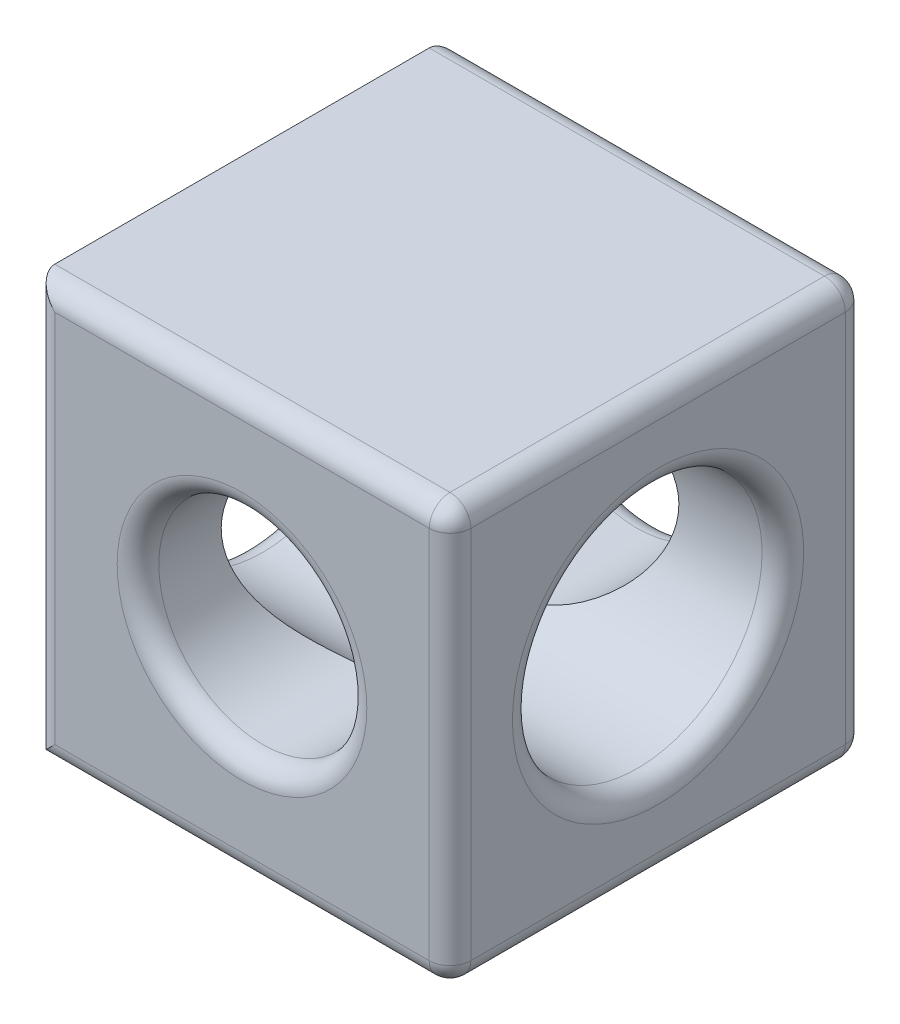
ISO-10303-21;
HEADER;
FILE_DESCRIPTION(('STEP AP214'),'2;1');
FILE_NAME('part.step','',(''),(''),'','','');
FILE_SCHEMA(('AUTOMOTIVE_DESIGN { 1 0 10303 214 1 1 1 1 }'));
ENDSEC;
DATA;
#1=APPLICATION_CONTEXT('core data for automotive mechanical design processes');
#2=APPLICATION_PROTOCOL_DEFINITION('international standard','automotive_design',2000,#1);
#3=PRODUCT_CONTEXT('',#1,'mechanical');
#4=PRODUCT('Part','Part','',(#3));
#5=PRODUCT_RELATED_PRODUCT_CATEGORY('part','',(#4));
#6=PRODUCT_DEFINITION_FORMATION('','',#4);
#7=PRODUCT_DEFINITION_CONTEXT('part definition',#1,'design');
#8=PRODUCT_DEFINITION('design','',#6,#7);
#9=PRODUCT_DEFINITION_SHAPE('','',#8);
#10=(LENGTH_UNIT() NAMED_UNIT(*) SI_UNIT(.MILLI.,.METRE.));
#11=(NAMED_UNIT(*) PLANE_ANGLE_UNIT() SI_UNIT($,.RADIAN.));
#12=(NAMED_UNIT(*) SI_UNIT($,.STERADIAN.) SOLID_ANGLE_UNIT());
#13=UNCERTAINTY_MEASURE_WITH_UNIT(LENGTH_MEASURE(1.E-05),#10,'distance_accuracy_value','');
#14=(GEOMETRIC_REPRESENTATION_CONTEXT(3) GLOBAL_UNCERTAINTY_ASSIGNED_CONTEXT((#13)) GLOBAL_UNIT_ASSIGNED_CONTEXT((#10,
#11,#12)) REPRESENTATION_CONTEXT('',''));
#15=CARTESIAN_POINT('',(0.,0.,0.));
#16=DIRECTION('',(0.,0.,1.));
#17=DIRECTION('',(1.,0.,0.));
#18=AXIS2_PLACEMENT_3D('',#15,#16,#17);
#19=CARTESIAN_POINT('',(0.,10.,10.));
#20=DIRECTION('',(1.,0.,0.));
#21=DIRECTION('',(0.,1.,0.));
#22=AXIS2_PLACEMENT_3D('',#19,#20,#21);
#23=PLANE('',#22);
#24=CARTESIAN_POINT('',(0.,5.,5.));
#25=DIRECTION('',(1.,0.,0.));
#26=DIRECTION('',(0.,1.,0.));
#27=AXIS2_PLACEMENT_3D('',#24,#25,#26);
#28=CIRCLE('',#27,3.5);
#29=CARTESIAN_POINT('',(0.,8.5,5.));
#30=VERTEX_POINT('',#29);
#31=EDGE_CURVE('E236',#30,#30,#28,.T.);
#32=ORIENTED_EDGE('',*,*,#31,.T.);
#33=EDGE_LOOP('',(#32));
#34=FACE_BOUND('',#33,.T.);
#35=DIRECTION('',(0.,0.,-1.));
#36=VECTOR('',#35,1.);
#37=CARTESIAN_POINT('',(0.,10.,10.));
#38=LINE('',#37,#36);
#39=CARTESIAN_POINT('',(0.,10.,9.5));
#40=VERTEX_POINT('',#39);
#41=CARTESIAN_POINT('',(0.,10.,0.5));
#42=VERTEX_POINT('',#41);
#43=EDGE_CURVE('E138',#40,#42,#38,.T.);
#44=ORIENTED_EDGE('',*,*,#43,.T.);
#45=DIRECTION('',(0.,-1.,0.));
#46=VECTOR('',#45,1.);
#47=CARTESIAN_POINT('',(0.,10.,0.5));
#48=LINE('',#47,#46);
#49=CARTESIAN_POINT('',(0.,0.,0.5));
#50=VERTEX_POINT('',#49);
#51=EDGE_CURVE('E137',#42,#50,#48,.T.);
#52=ORIENTED_EDGE('',*,*,#51,.T.);
#53=DIRECTION('',(0.,0.,-1.));
#54=VECTOR('',#53,1.);
#55=CARTESIAN_POINT('',(0.,0.,10.));
#56=LINE('',#55,#54);
#57=CARTESIAN_POINT('',(0.,0.,9.5));
#58=VERTEX_POINT('',#57);
#59=EDGE_CURVE('E121',#58,#50,#56,.T.);
#60=ORIENTED_EDGE('',*,*,#59,.F.);
#61=DIRECTION('',(0.,-1.,0.));
#62=VECTOR('',#61,1.);
#63=CARTESIAN_POINT('',(0.,10.,9.5));
#64=LINE('',#63,#62);
#65=EDGE_CURVE('E134',#58,#40,#64,.F.);
#66=ORIENTED_EDGE('',*,*,#65,.T.);
#67=EDGE_LOOP('',(#44,#52,#60,#66));
#68=FACE_BOUND('',#67,.T.);
#69=ADVANCED_FACE('F39',(#34,#68),#23,.F.);
#70=CARTESIAN_POINT('',(0.,0.,10.));
#71=DIRECTION('',(0.,1.,0.));
#72=DIRECTION('',(0.,0.,1.));
#73=AXIS2_PLACEMENT_3D('',#70,#71,#72);
#74=PLANE('',#73);
#75=ORIENTED_EDGE('',*,*,#59,.T.);
#76=DIRECTION('',(1.,0.,0.));
#77=VECTOR('',#76,1.);
#78=CARTESIAN_POINT('',(0.,0.,0.5));
#79=LINE('',#78,#77);
#80=CARTESIAN_POINT('',(9.5,0.,0.5));
#81=VERTEX_POINT('',#80);
#82=EDGE_CURVE('E228',#50,#81,#79,.T.);
#83=ORIENTED_EDGE('',*,*,#82,.T.);
#84=DIRECTION('',(0.,0.,-1.));
#85=VECTOR('',#84,1.);
#86=CARTESIAN_POINT('',(9.5,0.,10.));
#87=LINE('',#86,#85);
#88=CARTESIAN_POINT('',(9.5,0.,9.5));
#89=VERTEX_POINT('',#88);
#90=EDGE_CURVE('E124',#81,#89,#87,.F.);
#91=ORIENTED_EDGE('',*,*,#90,.T.);
#92=DIRECTION('',(1.,0.,0.));
#93=VECTOR('',#92,1.);
#94=CARTESIAN_POINT('',(0.,0.,9.5));
#95=LINE('',#94,#93);
#96=EDGE_CURVE('E117',#89,#58,#95,.F.);
#97=ORIENTED_EDGE('',*,*,#96,.T.);
#98=EDGE_LOOP('',(#75,#83,#91,#97));
#99=FACE_BOUND('',#98,.T.);
#100=ADVANCED_FACE('F119',(#99),#74,.F.);
#101=CARTESIAN_POINT('',(10.,10.,10.));
#102=DIRECTION('',(-1.,0.,0.));
#103=DIRECTION('',(0.,0.,1.));
#104=AXIS2_PLACEMENT_3D('',#101,#102,#103);
#105=PLANE('',#104);
#106=CARTESIAN_POINT('',(10.,5.,5.));
#107=DIRECTION('',(-1.,0.,0.));
#108=DIRECTION('',(0.,0.,1.));
#109=AXIS2_PLACEMENT_3D('',#106,#107,#108);
#110=CIRCLE('',#109,3.5);
#111=CARTESIAN_POINT('',(10.,5.,8.5));
#112=VERTEX_POINT('',#111);
#113=EDGE_CURVE('E195',#112,#112,#110,.T.);
#114=ORIENTED_EDGE('',*,*,#113,.T.);
#115=EDGE_LOOP('',(#114));
#116=FACE_BOUND('',#115,.T.);
#117=DIRECTION('',(0.,0.,-1.));
#118=VECTOR('',#117,1.);
#119=CARTESIAN_POINT('',(10.,0.5,10.));
#120=LINE('',#119,#118);
#121=CARTESIAN_POINT('',(10.,0.5,9.5));
#122=VERTEX_POINT('',#121);
#123=CARTESIAN_POINT('',(10.,0.5,0.5));
#124=VERTEX_POINT('',#123);
#125=EDGE_CURVE('E200',#122,#124,#120,.T.);
#126=ORIENTED_EDGE('',*,*,#125,.T.);
#127=DIRECTION('',(0.,1.,0.));
#128=VECTOR('',#127,1.);
#129=CARTESIAN_POINT('',(10.,10.,0.5));
#130=LINE('',#129,#128);
#131=CARTESIAN_POINT('',(10.,9.5,0.5));
#132=VERTEX_POINT('',#131);
#133=EDGE_CURVE('E198',#124,#132,#130,.T.);
#134=ORIENTED_EDGE('',*,*,#133,.T.);
#135=DIRECTION('',(0.,0.,-1.));
#136=VECTOR('',#135,1.);
#137=CARTESIAN_POINT('',(10.,9.5,10.));
#138=LINE('',#137,#136);
#139=CARTESIAN_POINT('',(10.,9.5,9.5));
#140=VERTEX_POINT('',#139);
#141=EDGE_CURVE('E203',#132,#140,#138,.F.);
#142=ORIENTED_EDGE('',*,*,#141,.T.);
#143=DIRECTION('',(0.,1.,0.));
#144=VECTOR('',#143,1.);
#145=CARTESIAN_POINT('',(10.,0.,9.5));
#146=LINE('',#145,#144);
#147=EDGE_CURVE('E205',#140,#122,#146,.F.);
#148=ORIENTED_EDGE('',*,*,#147,.T.);
#149=EDGE_LOOP('',(#126,#134,#142,#148));
#150=FACE_BOUND('',#149,.T.);
#151=ADVANCED_FACE('F278',(#116,#150),#105,.F.);
#152=CARTESIAN_POINT('',(0.,10.,10.));
#153=DIRECTION('',(0.,-1.,0.));
#154=DIRECTION('',(0.,0.,-1.));
#155=AXIS2_PLACEMENT_3D('',#152,#153,#154);
#156=PLANE('',#155);
#157=DIRECTION('',(0.,0.,-1.));
#158=VECTOR('',#157,1.);
#159=CARTESIAN_POINT('',(9.5,10.,10.));
#160=LINE('',#159,#158);
#161=CARTESIAN_POINT('',(9.5,10.,9.5));
#162=VERTEX_POINT('',#161);
#163=CARTESIAN_POINT('',(9.5,10.,0.5));
#164=VERTEX_POINT('',#163);
#165=EDGE_CURVE('E212',#162,#164,#160,.T.);
#166=ORIENTED_EDGE('',*,*,#165,.T.);
#167=DIRECTION('',(-1.,0.,0.));
#168=VECTOR('',#167,1.);
#169=CARTESIAN_POINT('',(0.,10.,0.5));
#170=LINE('',#169,#168);
#171=EDGE_CURVE('E210',#164,#42,#170,.T.);
#172=ORIENTED_EDGE('',*,*,#171,.T.);
#173=ORIENTED_EDGE('',*,*,#43,.F.);
#174=DIRECTION('',(-1.,0.,0.));
#175=VECTOR('',#174,1.);
#176=CARTESIAN_POINT('',(10.,10.,9.5));
#177=LINE('',#176,#175);
#178=EDGE_CURVE('E214',#40,#162,#177,.F.);
#179=ORIENTED_EDGE('',*,*,#178,.T.);
#180=EDGE_LOOP('',(#166,#172,#173,#179));
#181=FACE_BOUND('',#180,.T.);
#182=ADVANCED_FACE('F368',(#181),#156,.F.);
#183=CARTESIAN_POINT('',(0.,0.,10.));
#184=DIRECTION('',(0.,0.,1.));
#185=DIRECTION('',(1.,0.,0.));
#186=AXIS2_PLACEMENT_3D('',#183,#184,#185);
#187=PLANE('',#186);
#188=DIRECTION('',(0.,1.,0.));
#189=VECTOR('',#188,1.);
#190=CARTESIAN_POINT('',(9.5,10.,10.));
#191=LINE('',#190,#189);
#192=CARTESIAN_POINT('',(9.5,0.5,10.));
#193=VERTEX_POINT('',#192);
#194=CARTESIAN_POINT('',(9.5,9.5,10.));
#195=VERTEX_POINT('',#194);
#196=EDGE_CURVE('E56',#193,#195,#191,.T.);
#197=ORIENTED_EDGE('',*,*,#196,.T.);
#198=DIRECTION('',(-1.,0.,0.));
#199=VECTOR('',#198,1.);
#200=CARTESIAN_POINT('',(0.,9.5,10.));
#201=LINE('',#200,#199);
#202=CARTESIAN_POINT('',(0.5,9.5,10.));
#203=VERTEX_POINT('',#202);
#204=EDGE_CURVE('E48',#195,#203,#201,.T.);
#205=ORIENTED_EDGE('',*,*,#204,.T.);
#206=DIRECTION('',(0.,-1.,0.));
#207=VECTOR('',#206,1.);
#208=CARTESIAN_POINT('',(0.5,0.,10.));
#209=LINE('',#208,#207);
#210=CARTESIAN_POINT('',(0.5,0.5,10.));
#211=VERTEX_POINT('',#210);
#212=EDGE_CURVE('E190',#203,#211,#209,.T.);
#213=ORIENTED_EDGE('',*,*,#212,.T.);
#214=DIRECTION('',(1.,0.,0.));
#215=VECTOR('',#214,1.);
#216=CARTESIAN_POINT('',(10.,0.5,10.));
#217=LINE('',#216,#215);
#218=EDGE_CURVE('E61',#211,#193,#217,.T.);
#219=ORIENTED_EDGE('',*,*,#218,.T.);
#220=EDGE_LOOP('',(#197,#205,#213,#219));
#221=FACE_BOUND('',#220,.T.);
#222=CARTESIAN_POINT('',(5.,5.,10.));
#223=DIRECTION('',(0.,0.,1.));
#224=DIRECTION('',(1.,0.,0.));
#225=AXIS2_PLACEMENT_3D('',#222,#223,#224);
#226=CIRCLE('',#225,3.);
#227=CARTESIAN_POINT('',(8.,5.,10.));
#228=VERTEX_POINT('',#227);
#229=EDGE_CURVE('E192',#228,#228,#226,.F.);
#230=ORIENTED_EDGE('',*,*,#229,.T.);
#231=EDGE_LOOP('',(#230));
#232=FACE_BOUND('',#231,.T.);
#233=ADVANCED_FACE('F359',(#221,#232),#187,.T.);
#234=CARTESIAN_POINT('',(0.,0.,0.));
#235=DIRECTION('',(0.,0.,1.));
#236=DIRECTION('',(1.,0.,0.));
#237=AXIS2_PLACEMENT_3D('',#234,#235,#236);
#238=PLANE('',#237);
#239=CARTESIAN_POINT('',(5.,5.,0.));
#240=DIRECTION('',(0.,0.,1.));
#241=DIRECTION('',(1.,0.,0.));
#242=AXIS2_PLACEMENT_3D('',#239,#240,#241);
#243=CIRCLE('',#242,3.);
#244=CARTESIAN_POINT('',(8.,5.,0.));
#245=VERTEX_POINT('',#244);
#246=EDGE_CURVE('E216',#245,#245,#243,.T.);
#247=ORIENTED_EDGE('',*,*,#246,.T.);
#248=EDGE_LOOP('',(#247));
#249=FACE_BOUND('',#248,.T.);
#250=DIRECTION('',(1.,0.,0.));
#251=VECTOR('',#250,1.);
#252=CARTESIAN_POINT('',(0.,0.5,0.));
#253=LINE('',#252,#251);
#254=CARTESIAN_POINT('',(9.5,0.5,0.));
#255=VERTEX_POINT('',#254);
#256=CARTESIAN_POINT('',(0.5,0.5,0.));
#257=VERTEX_POINT('',#256);
#258=EDGE_CURVE('E221',#255,#257,#253,.F.);
#259=ORIENTED_EDGE('',*,*,#258,.T.);
#260=DIRECTION('',(0.,-1.,0.));
#261=VECTOR('',#260,1.);
#262=CARTESIAN_POINT('',(0.5,0.,0.));
#263=LINE('',#262,#261);
#264=CARTESIAN_POINT('',(0.5,9.5,0.));
#265=VERTEX_POINT('',#264);
#266=EDGE_CURVE('E219',#257,#265,#263,.F.);
#267=ORIENTED_EDGE('',*,*,#266,.T.);
#268=DIRECTION('',(-1.,0.,0.));
#269=VECTOR('',#268,1.);
#270=CARTESIAN_POINT('',(0.,9.5,0.));
#271=LINE('',#270,#269);
#272=CARTESIAN_POINT('',(9.5,9.5,0.));
#273=VERTEX_POINT('',#272);
#274=EDGE_CURVE('E224',#265,#273,#271,.F.);
#275=ORIENTED_EDGE('',*,*,#274,.T.);
#276=DIRECTION('',(0.,1.,0.));
#277=VECTOR('',#276,1.);
#278=CARTESIAN_POINT('',(9.5,0.,0.));
#279=LINE('',#278,#277);
#280=EDGE_CURVE('E226',#273,#255,#279,.F.);
#281=ORIENTED_EDGE('',*,*,#280,.T.);
#282=EDGE_LOOP('',(#259,#267,#275,#281));
#283=FACE_BOUND('',#282,.T.);
#284=ADVANCED_FACE('F349',(#249,#283),#238,.F.);
#285=CARTESIAN_POINT('',(0.,5.,5.));
#286=DIRECTION('',(1.,0.,0.));
#287=DIRECTION('',(0.,0.,-1.));
#288=AXIS2_PLACEMENT_3D('',#285,#286,#287);
#289=CYLINDRICAL_SURFACE('',#288,3.);
#290=CARTESIAN_POINT('',(0.5,5.,5.));
#291=DIRECTION('',(1.,0.,0.));
#292=DIRECTION('',(0.,1.,0.));
#293=AXIS2_PLACEMENT_3D('',#290,#291,#292);
#294=CIRCLE('',#293,3.);
#295=CARTESIAN_POINT('',(0.5,8.,5.));
#296=VERTEX_POINT('',#295);
#297=EDGE_CURVE('E129',#296,#296,#294,.F.);
#298=ORIENTED_EDGE('',*,*,#297,.T.);
#299=EDGE_LOOP('',(#298));
#300=FACE_BOUND('',#299,.T.);
#301=CARTESIAN_POINT('',(9.5,5.,5.));
#302=DIRECTION('',(-1.,0.,0.));
#303=DIRECTION('',(0.,0.,1.));
#304=AXIS2_PLACEMENT_3D('',#301,#302,#303);
#305=CIRCLE('',#304,3.);
#306=CARTESIAN_POINT('',(9.5,5.,8.));
#307=VERTEX_POINT('',#306);
#308=EDGE_CURVE('E233',#307,#307,#305,.F.);
#309=ORIENTED_EDGE('',*,*,#308,.T.);
#310=EDGE_LOOP('',(#309));
#311=FACE_BOUND('',#310,.T.);
#312=CARTESIAN_POINT('',(2.5,5.,2.));
#313=CARTESIAN_POINT('',(2.50000488555368,5.1187575331932,2.00000477204795));
#314=CARTESIAN_POINT('',(2.50852250390458,5.23755128110413,2.00711329405258));
#315=CARTESIAN_POINT('',(2.54196272335183,5.47118249249281,2.03489237131732));
#316=CARTESIAN_POINT('',(2.56689747397531,5.58601695961242,2.05557297057993));
#317=CARTESIAN_POINT('',(2.63131211733271,5.8078299424073,2.10857309761135));
#318=CARTESIAN_POINT('',(2.67070507435371,5.9148509209049,2.1408230344993));
#319=CARTESIAN_POINT('',(2.76201704794258,6.11984139043408,2.21470823817097));
#320=CARTESIAN_POINT('',(2.81394029667325,6.21780780775233,2.25634667565064));
#321=CARTESIAN_POINT('',(2.94945374980816,6.43789998519767,2.36325808470133));
#322=CARTESIAN_POINT('',(3.03767020418218,6.5556821965722,2.43159450743809));
#323=CARTESIAN_POINT('',(3.23052432575137,6.77202398328147,2.57577375222326));
#324=CARTESIAN_POINT('',(3.33520756924311,6.87052845158605,2.65163718546724));
#325=CARTESIAN_POINT('',(3.50408427649109,7.00437263805588,2.76705113686262));
#326=CARTESIAN_POINT('',(3.5629555761913,7.04699726278815,2.80616320005003));
#327=CARTESIAN_POINT('',(3.6845056029605,7.12715295529554,2.88379388190807));
#328=CARTESIAN_POINT('',(3.74718559487074,7.16468231743739,2.92231229804977));
#329=CARTESIAN_POINT('',(3.87626732433561,7.23441122570746,2.99749456711339));
#330=CARTESIAN_POINT('',(3.94265978472482,7.26662332666226,3.03416264245349));
#331=CARTESIAN_POINT('',(4.07944628392839,7.32553690612792,3.10422313369689));
#332=CARTESIAN_POINT('',(4.14983684734179,7.3522430799868,3.13761832779096));
#333=CARTESIAN_POINT('',(4.3016670902001,7.40193513934005,3.20208081019588));
#334=CARTESIAN_POINT('',(4.38352409272348,7.42433807692598,3.23263688748997));
#335=CARTESIAN_POINT('',(4.5518897688131,7.46101313675502,3.28406819443997));
#336=CARTESIAN_POINT('',(4.63838658661467,7.47530499393792,3.30496689805803));
#337=CARTESIAN_POINT('',(4.81576540837945,7.49481072799048,3.33379071031156));
#338=CARTESIAN_POINT('',(4.90668795907069,7.49991205058667,3.34155489436907));
#339=CARTESIAN_POINT('',(5.08856261300276,7.5000856937119,3.34181691468175));
#340=CARTESIAN_POINT('',(5.17951471661533,7.49515788278404,3.3343145508306));
#341=CARTESIAN_POINT('',(5.36552471082712,7.47505262029594,3.30458360535503));
#342=CARTESIAN_POINT('',(5.46029374571706,7.45905577113332,3.28118067933533));
#343=CARTESIAN_POINT('',(5.64421098120217,7.41742550503027,3.22311764261086));
#344=CARTESIAN_POINT('',(5.73333937071482,7.39176011044289,3.18842022896975));
#345=CARTESIAN_POINT('',(5.8878270785411,7.33816270346873,3.11997773873863));
#346=CARTESIAN_POINT('',(5.95431224241165,7.31177513033566,3.08749683154561));
#347=CARTESIAN_POINT('',(6.08365080677993,7.25404424958636,3.01978003338471));
#348=CARTESIAN_POINT('',(6.14650204786584,7.22269803586306,2.98454253302215));
#349=CARTESIAN_POINT('',(6.32996684101967,7.12149677560466,2.87657351890276));
#350=CARTESIAN_POINT('',(6.44541414760608,7.04450664231777,2.80162303032562));
#351=CARTESIAN_POINT('',(6.66826696245435,6.86765914501414,2.64920102047722));
#352=CARTESIAN_POINT('',(6.77493832399189,6.76681805277628,2.57180207381056));
#353=CARTESIAN_POINT('',(6.9711123448174,6.54484388336149,2.42490945956715));
#354=CARTESIAN_POINT('',(7.06065203305626,6.42375565615773,2.35539887732636));
#355=CARTESIAN_POINT('',(7.19941483909855,6.19411179169416,2.24571085873453));
#356=CARTESIAN_POINT('',(7.25314289818765,6.08972732107277,2.20251649926005));
#357=CARTESIAN_POINT('',(7.34634274525534,5.87107145833037,2.12692195980199));
#358=CARTESIAN_POINT('',(7.38582343158057,5.75680629278076,2.09451504339195));
#359=CARTESIAN_POINT('',(7.4484172499322,5.51995430121542,2.04290165734435));
#360=CARTESIAN_POINT('',(7.47140394665756,5.39731092312531,2.02379719044156));
#361=CARTESIAN_POINT('',(7.49870923192718,5.14855997692373,2.00108565471028));
#362=CARTESIAN_POINT('',(7.50304031085016,5.022454783524,1.99746821695823));
#363=CARTESIAN_POINT('',(7.49333756055624,4.78668980054343,2.00555000960853));
#364=CARTESIAN_POINT('',(7.48144136128483,4.67686945916414,2.01546649283687));
#365=CARTESIAN_POINT('',(7.44373304978851,4.4613550355994,2.04674410539865));
#366=CARTESIAN_POINT('',(7.41791926828104,4.35566145001044,2.06810660757204));
#367=CARTESIAN_POINT('',(7.35337660454474,4.14943450080075,2.12110478453814));
#368=CARTESIAN_POINT('',(7.31447921055573,4.04898931777669,2.15287435108026));
#369=CARTESIAN_POINT('',(7.2256043676633,3.85634099101897,2.2246387526611));
#370=CARTESIAN_POINT('',(7.17562282300671,3.7641409116879,2.26463662778192));
#371=CARTESIAN_POINT('',(7.04156820465303,3.54932560264901,2.37024847841406));
#372=CARTESIAN_POINT('',(6.9522674167327,3.43165640459269,2.43929755765286));
#373=CARTESIAN_POINT('',(6.75715961734437,3.21571005259153,2.58477554596809));
#374=CARTESIAN_POINT('',(6.65130154464526,3.11749509144827,2.66122699577165));
#375=CARTESIAN_POINT('',(6.48058803207139,2.98426685215709,2.77730194401399));
#376=CARTESIAN_POINT('',(6.42110172702402,2.94188930856051,2.8165884826397));
#377=CARTESIAN_POINT('',(6.29827918396773,2.86228330402594,2.89446846182819));
#378=CARTESIAN_POINT('',(6.2349415723359,2.82505669593245,2.93306164866393));
#379=CARTESIAN_POINT('',(6.10451159608481,2.75601142973243,3.0082389151736));
#380=CARTESIAN_POINT('',(6.0374297754664,2.72417851218462,3.04482811365788));
#381=CARTESIAN_POINT('',(5.89920989550017,2.6661114326054,3.11452438551821));
#382=CARTESIAN_POINT('',(5.82807562958063,2.63987214015345,3.1476346354921));
#383=CARTESIAN_POINT('',(5.67572963164812,2.59162642851678,3.21074442583953));
#384=CARTESIAN_POINT('',(5.59416554892628,2.57011685681456,3.24029288213346));
#385=CARTESIAN_POINT('',(5.4265480460574,2.53517744310486,3.28956936112573));
#386=CARTESIAN_POINT('',(5.34050642867212,2.52172742286643,3.30932188774741));
#387=CARTESIAN_POINT('',(5.16436239258767,2.50382710464737,3.3358468402054));
#388=CARTESIAN_POINT('',(5.07422467024932,2.4994820081604,3.34246748951609));
#389=CARTESIAN_POINT('',(4.89414678721606,2.50061802895545,3.34075691369333));
#390=CARTESIAN_POINT('',(4.80420668487486,2.50610173725988,3.33242174597845));
#391=CARTESIAN_POINT('',(4.61832742460948,2.5273473615146,3.30107101264481));
#392=CARTESIAN_POINT('',(4.52276972946732,2.54414187449239,3.27658628976142));
#393=CARTESIAN_POINT('',(4.33746870391729,2.58749660324909,3.21641271962613));
#394=CARTESIAN_POINT('',(4.2477457712907,2.61408911714091,3.18068687468674));
#395=CARTESIAN_POINT('',(4.09221095864516,2.66949164155081,3.11047380633806));
#396=CARTESIAN_POINT('',(4.02525624076508,2.69674146950469,3.07722183372209));
#397=CARTESIAN_POINT('',(3.8950536135756,2.75629372981988,3.0080481476943));
#398=CARTESIAN_POINT('',(3.83180788900019,2.78859909979136,2.97212488849481));
#399=CARTESIAN_POINT('',(3.64727043865804,2.89283705571015,2.86224068832088));
#400=CARTESIAN_POINT('',(3.53125307500807,2.97206423256249,2.7862021983568));
#401=CARTESIAN_POINT('',(3.30799273870875,3.15370302432586,2.63227396236454));
#402=CARTESIAN_POINT('',(3.20145820596708,3.2570604040672,2.55447605570488));
#403=CARTESIAN_POINT('',(3.00613620046066,3.48446445064379,2.40743501572246));
#404=CARTESIAN_POINT('',(2.91730943412605,3.60846416336785,2.33817307456932));
#405=CARTESIAN_POINT('',(2.78168580327691,3.84144481858917,2.23057694218492));
#406=CARTESIAN_POINT('',(2.72996148978056,3.94600122052306,2.18887825993118));
#407=CARTESIAN_POINT('',(2.64078132976142,4.16456021394564,2.11638539333548));
#408=CARTESIAN_POINT('',(2.60330647590471,4.27854997324609,2.0855766867623));
#409=CARTESIAN_POINT('',(2.54981154417341,4.49337996111314,2.0414125409531));
#410=CARTESIAN_POINT('',(2.53122487777322,4.59315453123808,2.02597857601889));
#411=CARTESIAN_POINT('',(2.50631763176192,4.79527727434576,2.00527077205592));
#412=CARTESIAN_POINT('',(2.49999578841308,4.89762518107722,1.99999588626059));
#413=CARTESIAN_POINT('',(2.5,5.,2.));
#414=B_SPLINE_CURVE_WITH_KNOTS('',3,(#312,#313,#314,#315,#316,#317,#318,#319,#320,#321,#322,
#323,#324,#325,#326,#327,#328,#329,#330,#331,#332,#333,#334,#335,#336,#337,#338,#339,#340,#341,
#342,#343,#344,#345,#346,#347,#348,#349,#350,#351,#352,#353,#354,#355,#356,#357,#358,#359,#360,
#361,#362,#363,#364,#365,#366,#367,#368,#369,#370,#371,#372,#373,#374,#375,#376,#377,#378,#379,
#380,#381,#382,#383,#384,#385,#386,#387,#388,#389,#390,#391,#392,#393,#394,#395,#396,#397,#398,
#399,#400,#401,#402,#403,#404,#405,#406,#407,#408,#409,#410,#411,#412,#413),.UNSPECIFIED.,.T.,
.F.,(4,2,2,2,2,2,2,2,2,2,2,2,2,2,2,2,2,2,2,2,2,2,2,2,2,2,2,2,2,2,2,2,2,2,2,2,2,2,2,2,2,2,2,2,2,
2,2,2,2,2,4),(0.,0.355841276815113,0.711946191026961,1.06594405359551,1.42006164830116,
1.90425178760126,2.38980643116775,2.63722280423449,2.88472179650724,3.13162777943676,
3.37832232674674,3.64812890035755,3.91727616616869,4.18969776924975,4.46212294312047,
4.75723524199722,5.05333228584568,5.28870178855694,5.52420974868633,5.9954933935898,
6.49137310548271,6.98616858956867,7.36002155957575,7.73364063000475,8.11009395319721,
8.4862951927436,8.81743460677926,9.14861374669871,9.48423297747606,9.81997643164433,
10.3065635514456,10.7946819775667,11.0432812121088,11.2919696391639,11.5399899810636,
11.787781852862,12.0551105531685,12.3217671309317,12.5914881373799,12.8612802568452,
13.1598101383752,13.4593330283462,13.6977271411687,13.9362602949129,14.4135864576438,
14.914300110886,15.413889999571,15.7841228897598,16.1538601797496,16.4606444271243,
16.7673970625124),.UNSPECIFIED.);
#415=CARTESIAN_POINT('',(2.5,5.,2.));
#416=VERTEX_POINT('',#415);
#417=EDGE_CURVE('E240',#416,#416,#414,.T.);
#418=ORIENTED_EDGE('',*,*,#417,.T.);
#419=EDGE_LOOP('',(#418));
#420=FACE_BOUND('',#419,.T.);
#421=CARTESIAN_POINT('',(7.5,5.,8.));
#422=CARTESIAN_POINT('',(7.49999511444632,5.1187575331932,7.99999522795205));
#423=CARTESIAN_POINT('',(7.49147749609542,5.23755128110413,7.99288670594743));
#424=CARTESIAN_POINT('',(7.45803727664816,5.47118249249281,7.96510762868268));
#425=CARTESIAN_POINT('',(7.43310252602469,5.58601695961242,7.94442702942008));
#426=CARTESIAN_POINT('',(7.36868788266729,5.8078299424073,7.89142690238865));
#427=CARTESIAN_POINT('',(7.32929492564629,5.9148509209049,7.8591769655007));
#428=CARTESIAN_POINT('',(7.23798295205742,6.11984139043408,7.78529176182902));
#429=CARTESIAN_POINT('',(7.18605970332675,6.21780780775233,7.74365332434936));
#430=CARTESIAN_POINT('',(7.05054625019184,6.43789998519767,7.63674191529867));
#431=CARTESIAN_POINT('',(6.96232979581782,6.5556821965722,7.56840549256191));
#432=CARTESIAN_POINT('',(6.76947567424863,6.77202398328147,7.42422624777674));
#433=CARTESIAN_POINT('',(6.66479243075689,6.87052845158605,7.34836281453276));
#434=CARTESIAN_POINT('',(6.49591572350891,7.00437263805588,7.23294886313738));
#435=CARTESIAN_POINT('',(6.4370444238087,7.04699726278815,7.19383679994997));
#436=CARTESIAN_POINT('',(6.3154943970395,7.12715295529554,7.11620611809193));
#437=CARTESIAN_POINT('',(6.25281440512926,7.16468231743739,7.07768770195023));
#438=CARTESIAN_POINT('',(6.12373267566439,7.23441122570746,7.00250543288661));
#439=CARTESIAN_POINT('',(6.05734021527518,7.26662332666226,6.96583735754651));
#440=CARTESIAN_POINT('',(5.92055371607161,7.32553690612792,6.89577686630311));
#441=CARTESIAN_POINT('',(5.85016315265821,7.3522430799868,6.86238167220904));
#442=CARTESIAN_POINT('',(5.6983329097999,7.40193513934005,6.79791918980412));
#443=CARTESIAN_POINT('',(5.61647590727652,7.42433807692598,6.76736311251003));
#444=CARTESIAN_POINT('',(5.4481102311869,7.46101313675502,6.71593180556004));
#445=CARTESIAN_POINT('',(5.36161341338533,7.47530499393792,6.69503310194197));
#446=CARTESIAN_POINT('',(5.18423459162055,7.49481072799048,6.66620928968844));
#447=CARTESIAN_POINT('',(5.09331204092931,7.49991205058667,6.65844510563093));
#448=CARTESIAN_POINT('',(4.91143738699724,7.5000856937119,6.65818308531825));
#449=CARTESIAN_POINT('',(4.82048528338467,7.49515788278404,6.6656854491694));
#450=CARTESIAN_POINT('',(4.63447528917288,7.47505262029594,6.69541639464497));
#451=CARTESIAN_POINT('',(4.53970625428294,7.45905577113332,6.71881932066467));
#452=CARTESIAN_POINT('',(4.35578901879783,7.41742550503027,6.77688235738914));
#453=CARTESIAN_POINT('',(4.26666062928518,7.3917601104429,6.81157977103025));
#454=CARTESIAN_POINT('',(4.1121729214589,7.33816270346873,6.88002226126137));
#455=CARTESIAN_POINT('',(4.04568775758835,7.31177513033566,6.91250316845439));
#456=CARTESIAN_POINT('',(3.91634919322007,7.25404424958636,6.98021996661529));
#457=CARTESIAN_POINT('',(3.85349795213416,7.22269803586306,7.01545746697786));
#458=CARTESIAN_POINT('',(3.67003315898033,7.12149677560466,7.12342648109725));
#459=CARTESIAN_POINT('',(3.55458585239391,7.04450664231777,7.19837696967438));
#460=CARTESIAN_POINT('',(3.33173303754565,6.86765914501414,7.35079897952278));
#461=CARTESIAN_POINT('',(3.22506167600811,6.76681805277628,7.42819792618945));
#462=CARTESIAN_POINT('',(3.0288876551826,6.54484388336149,7.57509054043285));
#463=CARTESIAN_POINT('',(2.93934796694374,6.42375565615773,7.64460112267364));
#464=CARTESIAN_POINT('',(2.80058516090145,6.19411179169415,7.75428914126547));
#465=CARTESIAN_POINT('',(2.74685710181235,6.08972732107277,7.79748350073996));
#466=CARTESIAN_POINT('',(2.65365725474466,5.87107145833036,7.87307804019801));
#467=CARTESIAN_POINT('',(2.61417656841942,5.75680629278076,7.90548495660805));
#468=CARTESIAN_POINT('',(2.5515827500678,5.51995430121542,7.95709834265565));
#469=CARTESIAN_POINT('',(2.52859605334244,5.39731092312531,7.97620280955844));
#470=CARTESIAN_POINT('',(2.50129076807281,5.14855997692372,7.99891434528972));
#471=CARTESIAN_POINT('',(2.49695968914984,5.022454783524,8.00253178304177));
#472=CARTESIAN_POINT('',(2.50666243944376,4.78668980054342,7.99444999039147));
#473=CARTESIAN_POINT('',(2.51855863871517,4.67686945916414,7.98453350716313));
#474=CARTESIAN_POINT('',(2.55626695021149,4.46135503559939,7.95325589460135));
#475=CARTESIAN_POINT('',(2.58208073171896,4.35566145001044,7.93189339242796));
#476=CARTESIAN_POINT('',(2.64662339545526,4.14943450080074,7.87889521546186));
#477=CARTESIAN_POINT('',(2.68552078944427,4.04898931777668,7.84712564891974));
#478=CARTESIAN_POINT('',(2.7743956323367,3.85634099101896,7.77536124733889));
#479=CARTESIAN_POINT('',(2.82437717699329,3.7641409116879,7.73536337221808));
#480=CARTESIAN_POINT('',(2.95843179534697,3.549325602649,7.62975152158594));
#481=CARTESIAN_POINT('',(3.04773258326731,3.43165640459269,7.56070244234714));
#482=CARTESIAN_POINT('',(3.24284038265564,3.21571005259152,7.4152244540319));
#483=CARTESIAN_POINT('',(3.34869845535475,3.11749509144827,7.33877300422834));
#484=CARTESIAN_POINT('',(3.51941196792862,2.98426685215709,7.222698055986));
#485=CARTESIAN_POINT('',(3.57889827297599,2.94188930856051,7.1834115173603));
#486=CARTESIAN_POINT('',(3.70172081603228,2.86228330402594,7.10553153817181));
#487=CARTESIAN_POINT('',(3.7650584276641,2.82505669593245,7.06693835133607));
#488=CARTESIAN_POINT('',(3.89548840391519,2.75601142973243,6.99176108482639));
#489=CARTESIAN_POINT('',(3.96257022453361,2.72417851218462,6.95517188634212));
#490=CARTESIAN_POINT('',(4.10079010449983,2.6661114326054,6.88547561448179));
#491=CARTESIAN_POINT('',(4.17192437041937,2.63987214015345,6.8523653645079));
#492=CARTESIAN_POINT('',(4.32427036835189,2.59162642851678,6.78925557416047));
#493=CARTESIAN_POINT('',(4.40583445107373,2.57011685681455,6.75970711786653));
#494=CARTESIAN_POINT('',(4.57345195394261,2.53517744310486,6.71043063887427));
#495=CARTESIAN_POINT('',(4.65949357132788,2.52172742286643,6.69067811225259));
#496=CARTESIAN_POINT('',(4.83563760741234,2.50382710464737,6.6641531597946));
#497=CARTESIAN_POINT('',(4.92577532975069,2.4994820081604,6.65753251048391));
#498=CARTESIAN_POINT('',(5.10585321278394,2.50061802895545,6.65924308630667));
#499=CARTESIAN_POINT('',(5.19579331512514,2.50610173725988,6.66757825402155));
#500=CARTESIAN_POINT('',(5.38167257539053,2.5273473615146,6.69892898735519));
#501=CARTESIAN_POINT('',(5.47723027053268,2.54414187449239,6.72341371023858));
#502=CARTESIAN_POINT('',(5.66253129608271,2.58749660324909,6.78358728037387));
#503=CARTESIAN_POINT('',(5.7522542287093,2.61408911714091,6.81931312531326));
#504=CARTESIAN_POINT('',(5.90778904135485,2.66949164155081,6.88952619366194));
#505=CARTESIAN_POINT('',(5.97474375923493,2.69674146950469,6.92277816627791));
#506=CARTESIAN_POINT('',(6.10494638642441,2.75629372981988,6.99195185230571));
#507=CARTESIAN_POINT('',(6.16819211099982,2.78859909979136,7.0278751115052));
#508=CARTESIAN_POINT('',(6.35272956134197,2.89283705571015,7.13775931167913));
#509=CARTESIAN_POINT('',(6.46874692499194,2.97206423256249,7.2137978016432));
#510=CARTESIAN_POINT('',(6.69200726129126,3.15370302432587,7.36772603763547));
#511=CARTESIAN_POINT('',(6.79854179403293,3.25706040406721,7.44552394429513));
#512=CARTESIAN_POINT('',(6.99386379953935,3.4844644506438,7.59256498427755));
#513=CARTESIAN_POINT('',(7.08269056587396,3.60846416336786,7.66182692543068));
#514=CARTESIAN_POINT('',(7.2183141967231,3.84144481858918,7.76942305781509));
#515=CARTESIAN_POINT('',(7.27003851021945,3.94600122052308,7.81112174006883));
#516=CARTESIAN_POINT('',(7.35921867023858,4.16456021394565,7.88361460666453));
#517=CARTESIAN_POINT('',(7.3966935240953,4.27854997324611,7.9144233132377));
#518=CARTESIAN_POINT('',(7.45018845582659,4.49337996111315,7.95858745904691));
#519=CARTESIAN_POINT('',(7.46877512222678,4.59315453123808,7.97402142398111));
#520=CARTESIAN_POINT('',(7.49368236823808,4.79527727434577,7.99472922794408));
#521=CARTESIAN_POINT('',(7.50000421158692,4.89762518107722,8.00000411373941));
#522=CARTESIAN_POINT('',(7.5,5.,8.));
#523=B_SPLINE_CURVE_WITH_KNOTS('',3,(#421,#422,#423,#424,#425,#426,#427,#428,#429,#430,#431,
#432,#433,#434,#435,#436,#437,#438,#439,#440,#441,#442,#443,#444,#445,#446,#447,#448,#449,#450,
#451,#452,#453,#454,#455,#456,#457,#458,#459,#460,#461,#462,#463,#464,#465,#466,#467,#468,#469,
#470,#471,#472,#473,#474,#475,#476,#477,#478,#479,#480,#481,#482,#483,#484,#485,#486,#487,#488,
#489,#490,#491,#492,#493,#494,#495,#496,#497,#498,#499,#500,#501,#502,#503,#504,#505,#506,#507,
#508,#509,#510,#511,#512,#513,#514,#515,#516,#517,#518,#519,#520,#521,#522),.UNSPECIFIED.,.T.,
.F.,(4,2,2,2,2,2,2,2,2,2,2,2,2,2,2,2,2,2,2,2,2,2,2,2,2,2,2,2,2,2,2,2,2,2,2,2,2,2,2,2,2,2,2,2,2,
2,2,2,2,2,4),(0.,0.355841276815112,0.711946191026961,1.06594405359551,1.42006164830116,
1.90425178760126,2.38980643116775,2.63722280423449,2.88472179650724,3.13162777943676,
3.37832232674674,3.64812890035754,3.91727616616869,4.18969776924975,4.46212294312047,
4.75723524199722,5.05333228584568,5.28870178855694,5.52420974868633,5.9954933935898,
6.49137310548272,6.98616858956867,7.36002155957576,7.73364063000476,8.11009395319721,
8.48629519274361,8.81743460677926,9.14861374669872,9.48423297747607,9.81997643164434,
10.3065635514456,10.7946819775667,11.0432812121088,11.2919696391639,11.5399899810636,
11.787781852862,12.0551105531685,12.3217671309317,12.5914881373799,12.8612802568452,
13.1598101383752,13.4593330283462,13.6977271411687,13.9362602949129,14.4135864576438,
14.914300110886,15.413889999571,15.7841228897598,16.1538601797496,16.4606444271243,
16.7673970625124),.UNSPECIFIED.);
#524=CARTESIAN_POINT('',(7.5,5.,8.));
#525=VERTEX_POINT('',#524);
#526=EDGE_CURVE('E248',#525,#525,#523,.T.);
#527=ORIENTED_EDGE('',*,*,#526,.T.);
#528=EDGE_LOOP('',(#527));
#529=FACE_BOUND('',#528,.T.);
#530=ADVANCED_FACE('F252',(#300,#311,#420,#529),#289,.F.);
#531=CARTESIAN_POINT('',(5.,5.,0.));
#532=DIRECTION('',(0.,0.,1.));
#533=DIRECTION('',(1.,0.,0.));
#534=AXIS2_PLACEMENT_3D('',#531,#532,#533);
#535=CYLINDRICAL_SURFACE('',#534,2.5);
#536=CARTESIAN_POINT('',(5.,5.,9.5));
#537=DIRECTION('',(0.,0.,1.));
#538=DIRECTION('',(1.,0.,0.));
#539=AXIS2_PLACEMENT_3D('',#536,#537,#538);
#540=CIRCLE('',#539,2.5);
#541=CARTESIAN_POINT('',(7.5,5.,9.5));
#542=VERTEX_POINT('',#541);
#543=EDGE_CURVE('E11',#542,#542,#540,.T.);
#544=ORIENTED_EDGE('',*,*,#543,.T.);
#545=EDGE_LOOP('',(#544));
#546=FACE_BOUND('',#545,.T.);
#547=ORIENTED_EDGE('',*,*,#526,.F.);
#548=EDGE_LOOP('',(#547));
#549=FACE_BOUND('',#548,.T.);
#550=ADVANCED_FACE('F259',(#546,#549),#535,.F.);
#551=CARTESIAN_POINT('',(5.,5.,0.5));
#552=DIRECTION('',(0.,0.,1.));
#553=DIRECTION('',(1.,0.,0.));
#554=AXIS2_PLACEMENT_3D('',#551,#552,#553);
#555=CIRCLE('',#554,2.5);
#556=CARTESIAN_POINT('',(7.5,5.,0.5));
#557=VERTEX_POINT('',#556);
#558=EDGE_CURVE('E207',#557,#557,#555,.F.);
#559=ORIENTED_EDGE('',*,*,#558,.T.);
#560=EDGE_LOOP('',(#559));
#561=FACE_BOUND('',#560,.T.);
#562=ORIENTED_EDGE('',*,*,#417,.F.);
#563=EDGE_LOOP('',(#562));
#564=FACE_BOUND('',#563,.T.);
#565=ADVANCED_FACE('F255',(#561,#564),#535,.F.);
#566=CARTESIAN_POINT('',(0.5,5.,5.));
#567=DIRECTION('',(1.,0.,0.));
#568=DIRECTION('',(0.,1.,0.));
#569=AXIS2_PLACEMENT_3D('',#566,#567,#568);
#570=TOROIDAL_SURFACE('',#569,3.5,0.5);
#571=ORIENTED_EDGE('',*,*,#297,.F.);
#572=EDGE_LOOP('',(#571));
#573=FACE_BOUND('',#572,.T.);
#574=ORIENTED_EDGE('',*,*,#31,.F.);
#575=EDGE_LOOP('',(#574));
#576=FACE_BOUND('',#575,.T.);
#577=ADVANCED_FACE('F258',(#573,#576),#570,.T.);
#578=CARTESIAN_POINT('',(0.,9.5,9.5));
#579=DIRECTION('',(1.,0.,0.));
#580=DIRECTION('',(0.,0.,-1.));
#581=AXIS2_PLACEMENT_3D('',#578,#579,#580);
#582=CYLINDRICAL_SURFACE('',#581,0.5);
#583=CARTESIAN_POINT('',(9.5,9.5,9.5));
#584=DIRECTION('',(1.,0.,0.));
#585=DIRECTION('',(0.,0.,-1.));
#586=AXIS2_PLACEMENT_3D('',#583,#584,#585);
#587=CIRCLE('',#586,0.5);
#588=EDGE_CURVE('E148',#162,#195,#587,.T.);
#589=ORIENTED_EDGE('',*,*,#588,.F.);
#590=ORIENTED_EDGE('',*,*,#178,.F.);
#591=CARTESIAN_POINT('',(0.5,9.5,9.5));
#592=DIRECTION('',(0.707106781186547,0.707106781186547,0.));
#593=DIRECTION('',(-0.707106781186547,0.707106781186547,0.));
#594=AXIS2_PLACEMENT_3D('',#591,#592,#593);
#595=ELLIPSE('',#594,0.707106781186547,0.5);
#596=EDGE_CURVE('E43',#203,#40,#595,.F.);
#597=ORIENTED_EDGE('',*,*,#596,.F.);
#598=ORIENTED_EDGE('',*,*,#204,.F.);
#599=EDGE_LOOP('',(#589,#590,#597,#598));
#600=FACE_BOUND('',#599,.T.);
#601=ADVANCED_FACE('F267',(#600),#582,.T.);
#602=CARTESIAN_POINT('',(0.5,0.,9.5));
#603=DIRECTION('',(0.,1.,0.));
#604=DIRECTION('',(-1.,0.,0.));
#605=AXIS2_PLACEMENT_3D('',#602,#603,#604);
#606=CYLINDRICAL_SURFACE('',#605,0.5);
#607=ORIENTED_EDGE('',*,*,#596,.T.);
#608=ORIENTED_EDGE('',*,*,#65,.F.);
#609=CARTESIAN_POINT('',(0.5,0.5,9.5));
#610=DIRECTION('',(-0.707106781186547,0.707106781186547,0.));
#611=DIRECTION('',(0.707106781186547,0.707106781186547,0.));
#612=AXIS2_PLACEMENT_3D('',#609,#610,#611);
#613=ELLIPSE('',#612,0.707106781186547,0.5);
#614=EDGE_CURVE('E144',#211,#58,#613,.F.);
#615=ORIENTED_EDGE('',*,*,#614,.F.);
#616=ORIENTED_EDGE('',*,*,#212,.F.);
#617=EDGE_LOOP('',(#607,#608,#615,#616));
#618=FACE_BOUND('',#617,.T.);
#619=ADVANCED_FACE('F143',(#618),#606,.T.);
#620=CARTESIAN_POINT('',(9.5,9.5,9.5));
#621=DIRECTION('',(0.,0.,1.));
#622=DIRECTION('',(1.,0.,0.));
#623=AXIS2_PLACEMENT_3D('',#620,#621,#622);
#624=SPHERICAL_SURFACE('',#623,0.5);
#625=CARTESIAN_POINT('',(9.5,9.5,9.5));
#626=DIRECTION('',(0.,0.,1.));
#627=DIRECTION('',(1.,0.,0.));
#628=AXIS2_PLACEMENT_3D('',#625,#626,#627);
#629=CIRCLE('',#628,0.5);
#630=EDGE_CURVE('E153',#162,#140,#629,.F.);
#631=ORIENTED_EDGE('',*,*,#630,.F.);
#632=ORIENTED_EDGE('',*,*,#588,.T.);
#633=CARTESIAN_POINT('',(9.5,9.5,9.5));
#634=DIRECTION('',(0.,1.,0.));
#635=DIRECTION('',(0.,0.,1.));
#636=AXIS2_PLACEMENT_3D('',#633,#634,#635);
#637=CIRCLE('',#636,0.5);
#638=EDGE_CURVE('E149',#140,#195,#637,.F.);
#639=ORIENTED_EDGE('',*,*,#638,.F.);
#640=EDGE_LOOP('',(#631,#632,#639));
#641=FACE_BOUND('',#640,.T.);
#642=ADVANCED_FACE('F325',(#641),#624,.T.);
#643=CARTESIAN_POINT('',(0.,0.5,9.5));
#644=DIRECTION('',(-1.,0.,0.));
#645=DIRECTION('',(0.,0.,1.));
#646=AXIS2_PLACEMENT_3D('',#643,#644,#645);
#647=CYLINDRICAL_SURFACE('',#646,0.5);
#648=ORIENTED_EDGE('',*,*,#614,.T.);
#649=ORIENTED_EDGE('',*,*,#96,.F.);
#650=CARTESIAN_POINT('',(9.5,0.5,9.5));
#651=DIRECTION('',(1.,0.,0.));
#652=DIRECTION('',(0.,0.,-1.));
#653=AXIS2_PLACEMENT_3D('',#650,#651,#652);
#654=CIRCLE('',#653,0.5);
#655=EDGE_CURVE('E158',#193,#89,#654,.T.);
#656=ORIENTED_EDGE('',*,*,#655,.F.);
#657=ORIENTED_EDGE('',*,*,#218,.F.);
#658=EDGE_LOOP('',(#648,#649,#656,#657));
#659=FACE_BOUND('',#658,.T.);
#660=ADVANCED_FACE('F147',(#659),#647,.T.);
#661=CARTESIAN_POINT('',(9.5,0.,9.5));
#662=DIRECTION('',(0.,-1.,0.));
#663=DIRECTION('',(0.,0.,-1.));
#664=AXIS2_PLACEMENT_3D('',#661,#662,#663);
#665=CYLINDRICAL_SURFACE('',#664,0.5);
#666=ORIENTED_EDGE('',*,*,#638,.T.);
#667=ORIENTED_EDGE('',*,*,#196,.F.);
#668=CARTESIAN_POINT('',(9.5,0.5,9.5));
#669=DIRECTION('',(0.,-1.,0.));
#670=DIRECTION('',(0.,0.,-1.));
#671=AXIS2_PLACEMENT_3D('',#668,#669,#670);
#672=CIRCLE('',#671,0.5);
#673=EDGE_CURVE('E160',#122,#193,#672,.T.);
#674=ORIENTED_EDGE('',*,*,#673,.F.);
#675=ORIENTED_EDGE('',*,*,#147,.F.);
#676=EDGE_LOOP('',(#666,#667,#674,#675));
#677=FACE_BOUND('',#676,.T.);
#678=ADVANCED_FACE('F318',(#677),#665,.T.);
#679=CARTESIAN_POINT('',(9.5,9.5,10.));
#680=DIRECTION('',(0.,0.,-1.));
#681=DIRECTION('',(-1.,0.,0.));
#682=AXIS2_PLACEMENT_3D('',#679,#680,#681);
#683=CYLINDRICAL_SURFACE('',#682,0.5);
#684=ORIENTED_EDGE('',*,*,#630,.T.);
#685=ORIENTED_EDGE('',*,*,#141,.F.);
#686=CARTESIAN_POINT('',(9.5,9.5,0.5));
#687=DIRECTION('',(0.,0.,-1.));
#688=DIRECTION('',(-1.,0.,0.));
#689=AXIS2_PLACEMENT_3D('',#686,#687,#688);
#690=CIRCLE('',#689,0.5);
#691=EDGE_CURVE('E163',#164,#132,#690,.T.);
#692=ORIENTED_EDGE('',*,*,#691,.F.);
#693=ORIENTED_EDGE('',*,*,#165,.F.);
#694=EDGE_LOOP('',(#684,#685,#692,#693));
#695=FACE_BOUND('',#694,.T.);
#696=ADVANCED_FACE('F314',(#695),#683,.T.);
#697=CARTESIAN_POINT('',(9.5,0.5,9.5));
#698=DIRECTION('',(0.,0.,1.));
#699=DIRECTION('',(1.,0.,0.));
#700=AXIS2_PLACEMENT_3D('',#697,#698,#699);
#701=SPHERICAL_SURFACE('',#700,0.5);
#702=ORIENTED_EDGE('',*,*,#673,.T.);
#703=ORIENTED_EDGE('',*,*,#655,.T.);
#704=CARTESIAN_POINT('',(9.5,0.5,9.5));
#705=DIRECTION('',(0.,0.,1.));
#706=DIRECTION('',(1.,0.,0.));
#707=AXIS2_PLACEMENT_3D('',#704,#705,#706);
#708=CIRCLE('',#707,0.5);
#709=EDGE_CURVE('E169',#122,#89,#708,.F.);
#710=ORIENTED_EDGE('',*,*,#709,.F.);
#711=EDGE_LOOP('',(#702,#703,#710));
#712=FACE_BOUND('',#711,.T.);
#713=ADVANCED_FACE('F310',(#712),#701,.T.);
#714=CARTESIAN_POINT('',(9.5,9.5,0.5));
#715=DIRECTION('',(0.,1.,0.));
#716=DIRECTION('',(0.,0.,1.));
#717=AXIS2_PLACEMENT_3D('',#714,#715,#716);
#718=SPHERICAL_SURFACE('',#717,0.5);
#719=CARTESIAN_POINT('',(9.5,9.5,0.5));
#720=DIRECTION('',(0.,1.,0.));
#721=DIRECTION('',(0.,0.,1.));
#722=AXIS2_PLACEMENT_3D('',#719,#720,#721);
#723=CIRCLE('',#722,0.5);
#724=EDGE_CURVE('E172',#273,#132,#723,.F.);
#725=ORIENTED_EDGE('',*,*,#724,.F.);
#726=CARTESIAN_POINT('',(9.5,9.5,0.5));
#727=DIRECTION('',(1.,0.,0.));
#728=DIRECTION('',(0.,0.,-1.));
#729=AXIS2_PLACEMENT_3D('',#726,#727,#728);
#730=CIRCLE('',#729,0.5);
#731=EDGE_CURVE('E166',#164,#273,#730,.F.);
#732=ORIENTED_EDGE('',*,*,#731,.F.);
#733=ORIENTED_EDGE('',*,*,#691,.T.);
#734=EDGE_LOOP('',(#725,#732,#733));
#735=FACE_BOUND('',#734,.T.);
#736=ADVANCED_FACE('F306',(#735),#718,.T.);
#737=CARTESIAN_POINT('',(0.,9.5,0.5));
#738=DIRECTION('',(-1.,0.,0.));
#739=DIRECTION('',(0.,0.,1.));
#740=AXIS2_PLACEMENT_3D('',#737,#738,#739);
#741=CYLINDRICAL_SURFACE('',#740,0.5);
#742=ORIENTED_EDGE('',*,*,#731,.T.);
#743=ORIENTED_EDGE('',*,*,#274,.F.);
#744=CARTESIAN_POINT('',(0.5,9.5,0.5));
#745=DIRECTION('',(-0.707106781186547,-0.707106781186547,0.));
#746=DIRECTION('',(0.707106781186547,-0.707106781186547,0.));
#747=AXIS2_PLACEMENT_3D('',#744,#745,#746);
#748=ELLIPSE('',#747,0.707106781186547,0.5);
#749=EDGE_CURVE('E175',#42,#265,#748,.T.);
#750=ORIENTED_EDGE('',*,*,#749,.F.);
#751=ORIENTED_EDGE('',*,*,#171,.F.);
#752=EDGE_LOOP('',(#742,#743,#750,#751));
#753=FACE_BOUND('',#752,.T.);
#754=ADVANCED_FACE('F302',(#753),#741,.T.);
#755=CARTESIAN_POINT('',(9.5,0.5,10.));
#756=DIRECTION('',(0.,0.,-1.));
#757=DIRECTION('',(-1.,0.,0.));
#758=AXIS2_PLACEMENT_3D('',#755,#756,#757);
#759=CYLINDRICAL_SURFACE('',#758,0.5);
#760=ORIENTED_EDGE('',*,*,#709,.T.);
#761=ORIENTED_EDGE('',*,*,#90,.F.);
#762=CARTESIAN_POINT('',(9.5,0.5,0.5));
#763=DIRECTION('',(0.,0.,-1.));
#764=DIRECTION('',(-1.,0.,0.));
#765=AXIS2_PLACEMENT_3D('',#762,#763,#764);
#766=CIRCLE('',#765,0.5);
#767=EDGE_CURVE('E178',#124,#81,#766,.T.);
#768=ORIENTED_EDGE('',*,*,#767,.F.);
#769=ORIENTED_EDGE('',*,*,#125,.F.);
#770=EDGE_LOOP('',(#760,#761,#768,#769));
#771=FACE_BOUND('',#770,.T.);
#772=ADVANCED_FACE('F298',(#771),#759,.T.);
#773=CARTESIAN_POINT('',(9.5,10.,0.5));
#774=DIRECTION('',(0.,1.,0.));
#775=DIRECTION('',(0.,0.,1.));
#776=AXIS2_PLACEMENT_3D('',#773,#774,#775);
#777=CYLINDRICAL_SURFACE('',#776,0.5);
#778=ORIENTED_EDGE('',*,*,#724,.T.);
#779=ORIENTED_EDGE('',*,*,#133,.F.);
#780=CARTESIAN_POINT('',(9.5,0.5,0.5));
#781=DIRECTION('',(0.,-1.,0.));
#782=DIRECTION('',(1.,0.,0.));
#783=AXIS2_PLACEMENT_3D('',#780,#781,#782);
#784=CIRCLE('',#783,0.5);
#785=EDGE_CURVE('E181',#255,#124,#784,.T.);
#786=ORIENTED_EDGE('',*,*,#785,.F.);
#787=ORIENTED_EDGE('',*,*,#280,.F.);
#788=EDGE_LOOP('',(#778,#779,#786,#787));
#789=FACE_BOUND('',#788,.T.);
#790=ADVANCED_FACE('F294',(#789),#777,.T.);
#791=CARTESIAN_POINT('',(0.5,10.,0.5));
#792=DIRECTION('',(0.,-1.,0.));
#793=DIRECTION('',(1.,0.,0.));
#794=AXIS2_PLACEMENT_3D('',#791,#792,#793);
#795=CYLINDRICAL_SURFACE('',#794,0.5);
#796=ORIENTED_EDGE('',*,*,#749,.T.);
#797=ORIENTED_EDGE('',*,*,#266,.F.);
#798=CARTESIAN_POINT('',(0.5,0.5,0.5));
#799=DIRECTION('',(0.707106781186547,-0.707106781186547,0.));
#800=DIRECTION('',(-0.707106781186547,-0.707106781186547,0.));
#801=AXIS2_PLACEMENT_3D('',#798,#799,#800);
#802=ELLIPSE('',#801,0.707106781186547,0.5);
#803=EDGE_CURVE('E183',#50,#257,#802,.T.);
#804=ORIENTED_EDGE('',*,*,#803,.F.);
#805=ORIENTED_EDGE('',*,*,#51,.F.);
#806=EDGE_LOOP('',(#796,#797,#804,#805));
#807=FACE_BOUND('',#806,.T.);
#808=ADVANCED_FACE('F290',(#807),#795,.T.);
#809=CARTESIAN_POINT('',(9.5,0.5,0.5));
#810=DIRECTION('',(1.,0.,0.));
#811=DIRECTION('',(0.,0.,-1.));
#812=AXIS2_PLACEMENT_3D('',#809,#810,#811);
#813=SPHERICAL_SURFACE('',#812,0.5);
#814=ORIENTED_EDGE('',*,*,#785,.T.);
#815=ORIENTED_EDGE('',*,*,#767,.T.);
#816=CARTESIAN_POINT('',(9.5,0.5,0.5));
#817=DIRECTION('',(1.,0.,0.));
#818=DIRECTION('',(0.,0.,-1.));
#819=AXIS2_PLACEMENT_3D('',#816,#817,#818);
#820=CIRCLE('',#819,0.5);
#821=EDGE_CURVE('E185',#255,#81,#820,.F.);
#822=ORIENTED_EDGE('',*,*,#821,.F.);
#823=EDGE_LOOP('',(#814,#815,#822));
#824=FACE_BOUND('',#823,.T.);
#825=ADVANCED_FACE('F286',(#824),#813,.T.);
#826=CARTESIAN_POINT('',(0.,0.5,0.5));
#827=DIRECTION('',(1.,0.,0.));
#828=DIRECTION('',(0.,0.,-1.));
#829=AXIS2_PLACEMENT_3D('',#826,#827,#828);
#830=CYLINDRICAL_SURFACE('',#829,0.5);
#831=ORIENTED_EDGE('',*,*,#803,.T.);
#832=ORIENTED_EDGE('',*,*,#258,.F.);
#833=ORIENTED_EDGE('',*,*,#821,.T.);
#834=ORIENTED_EDGE('',*,*,#82,.F.);
#835=EDGE_LOOP('',(#831,#832,#833,#834));
#836=FACE_BOUND('',#835,.T.);
#837=ADVANCED_FACE('F282',(#836),#830,.T.);
#838=CARTESIAN_POINT('',(5.,5.,0.5));
#839=DIRECTION('',(0.,0.,1.));
#840=DIRECTION('',(1.,0.,0.));
#841=AXIS2_PLACEMENT_3D('',#838,#839,#840);
#842=TOROIDAL_SURFACE('',#841,3.,0.5);
#843=ORIENTED_EDGE('',*,*,#558,.F.);
#844=EDGE_LOOP('',(#843));
#845=FACE_BOUND('',#844,.T.);
#846=ORIENTED_EDGE('',*,*,#246,.F.);
#847=EDGE_LOOP('',(#846));
#848=FACE_BOUND('',#847,.T.);
#849=ADVANCED_FACE('F285',(#845,#848),#842,.T.);
#850=CARTESIAN_POINT('',(9.5,5.,5.));
#851=DIRECTION('',(-1.,0.,0.));
#852=DIRECTION('',(0.,0.,1.));
#853=AXIS2_PLACEMENT_3D('',#850,#851,#852);
#854=TOROIDAL_SURFACE('',#853,3.5,0.5);
#855=ORIENTED_EDGE('',*,*,#113,.F.);
#856=EDGE_LOOP('',(#855));
#857=FACE_BOUND('',#856,.T.);
#858=ORIENTED_EDGE('',*,*,#308,.F.);
#859=EDGE_LOOP('',(#858));
#860=FACE_BOUND('',#859,.T.);
#861=ADVANCED_FACE('F335',(#857,#860),#854,.T.);
#862=CARTESIAN_POINT('',(5.,5.,9.5));
#863=DIRECTION('',(0.,0.,1.));
#864=DIRECTION('',(1.,0.,0.));
#865=AXIS2_PLACEMENT_3D('',#862,#863,#864);
#866=TOROIDAL_SURFACE('',#865,3.,0.5);
#867=ORIENTED_EDGE('',*,*,#229,.F.);
#868=EDGE_LOOP('',(#867));
#869=FACE_BOUND('',#868,.T.);
#870=ORIENTED_EDGE('',*,*,#543,.F.);
#871=EDGE_LOOP('',(#870));
#872=FACE_BOUND('',#871,.T.);
#873=ADVANCED_FACE('F41',(#869,#872),#866,.T.);
#874=CLOSED_SHELL('',(#69,#100,#151,#182,#233,#284,#530,#550,#565,#577,#601,#619,#642,#660,#678,
#696,#713,#736,#754,#772,#790,#808,#825,#837,#849,#861,#873));
#875=MANIFOLD_SOLID_BREP('B2',#874);
#876=ADVANCED_BREP_SHAPE_REPRESENTATION('',(#18,#875),#14);
#877=SHAPE_DEFINITION_REPRESENTATION(#9,#876);
ENDSEC;
END-ISO-10303-21;
